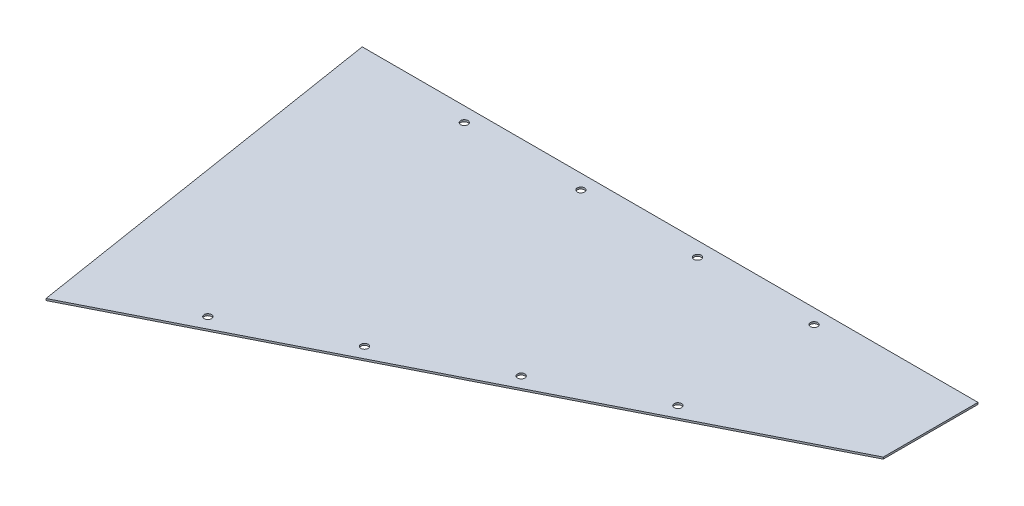
ISO-10303-21;
HEADER;
FILE_DESCRIPTION(('STEP AP214'),'2;1');
FILE_NAME('part.step','',(''),(''),'','','');
FILE_SCHEMA(('AUTOMOTIVE_DESIGN { 1 0 10303 214 1 1 1 1 }'));
ENDSEC;
DATA;
#1=APPLICATION_CONTEXT('core data for automotive mechanical design processes');
#2=APPLICATION_PROTOCOL_DEFINITION('international standard','automotive_design',2000,#1);
#3=PRODUCT_CONTEXT('',#1,'mechanical');
#4=PRODUCT('Part','Part','',(#3));
#5=PRODUCT_RELATED_PRODUCT_CATEGORY('part','',(#4));
#6=PRODUCT_DEFINITION_FORMATION('','',#4);
#7=PRODUCT_DEFINITION_CONTEXT('part definition',#1,'design');
#8=PRODUCT_DEFINITION('design','',#6,#7);
#9=PRODUCT_DEFINITION_SHAPE('','',#8);
#10=(LENGTH_UNIT() NAMED_UNIT(*) SI_UNIT(.MILLI.,.METRE.));
#11=(NAMED_UNIT(*) PLANE_ANGLE_UNIT() SI_UNIT($,.RADIAN.));
#12=(NAMED_UNIT(*) SI_UNIT($,.STERADIAN.) SOLID_ANGLE_UNIT());
#13=UNCERTAINTY_MEASURE_WITH_UNIT(LENGTH_MEASURE(1.E-05),#10,'distance_accuracy_value','');
#14=(GEOMETRIC_REPRESENTATION_CONTEXT(3) GLOBAL_UNCERTAINTY_ASSIGNED_CONTEXT((#13)) GLOBAL_UNIT_ASSIGNED_CONTEXT((#10,
#11,#12)) REPRESENTATION_CONTEXT('',''));
#15=CARTESIAN_POINT('',(0.,0.,0.));
#16=DIRECTION('',(0.,0.,1.));
#17=DIRECTION('',(1.,0.,0.));
#18=AXIS2_PLACEMENT_3D('',#15,#16,#17);
#19=CARTESIAN_POINT('',(-968.887028117865,3.175,490.232750073812));
#20=DIRECTION('',(-0.451473730325378,0.,-0.89228441139924));
#21=DIRECTION('',(-0.89228441139924,0.,0.451473730325378));
#22=AXIS2_PLACEMENT_3D('',#19,#20,#21);
#23=PLANE('',#22);
#24=DIRECTION('',(0.89228441139924,0.,-0.451473730325378));
#25=VECTOR('',#24,1.);
#26=CARTESIAN_POINT('',(-968.887028117865,0.,490.232750073812));
#27=LINE('',#26,#25);
#28=CARTESIAN_POINT('',(-968.887028117865,0.,490.232750073812));
#29=VERTEX_POINT('',#28);
#30=CARTESIAN_POINT('',(0.,0.,0.));
#31=VERTEX_POINT('',#30);
#32=EDGE_CURVE('E95',#29,#31,#27,.T.);
#33=ORIENTED_EDGE('',*,*,#32,.T.);
#34=DIRECTION('',(0.,-1.,0.));
#35=VECTOR('',#34,1.);
#36=CARTESIAN_POINT('',(0.,3.175,0.));
#37=LINE('',#36,#35);
#38=CARTESIAN_POINT('',(0.,3.175,0.));
#39=VERTEX_POINT('',#38);
#40=EDGE_CURVE('E11',#39,#31,#37,.T.);
#41=ORIENTED_EDGE('',*,*,#40,.F.);
#42=DIRECTION('',(0.89228441139924,0.,-0.451473730325378));
#43=VECTOR('',#42,1.);
#44=CARTESIAN_POINT('',(-968.887028117865,3.175,490.232750073812));
#45=LINE('',#44,#43);
#46=CARTESIAN_POINT('',(-968.887028117865,3.175,490.232750073812));
#47=VERTEX_POINT('',#46);
#48=EDGE_CURVE('E83',#47,#39,#45,.T.);
#49=ORIENTED_EDGE('',*,*,#48,.F.);
#50=DIRECTION('',(0.,-1.,0.));
#51=VECTOR('',#50,1.);
#52=CARTESIAN_POINT('',(-968.887028117865,3.175,490.232750073812));
#53=LINE('',#52,#51);
#54=EDGE_CURVE('E91',#47,#29,#53,.T.);
#55=ORIENTED_EDGE('',*,*,#54,.T.);
#56=EDGE_LOOP('',(#33,#41,#49,#55));
#57=FACE_BOUND('',#56,.T.);
#58=ADVANCED_FACE('F32',(#57),#23,.F.);
#59=CARTESIAN_POINT('',(0.,3.175,0.));
#60=DIRECTION('',(-1.,0.,0.));
#61=DIRECTION('',(0.,0.,1.));
#62=AXIS2_PLACEMENT_3D('',#59,#60,#61);
#63=PLANE('',#62);
#64=DIRECTION('',(0.,0.,-1.));
#65=VECTOR('',#64,1.);
#66=CARTESIAN_POINT('',(0.,0.,0.));
#67=LINE('',#66,#65);
#68=CARTESIAN_POINT('',(0.,0.,-165.1));
#69=VERTEX_POINT('',#68);
#70=EDGE_CURVE('E87',#31,#69,#67,.T.);
#71=ORIENTED_EDGE('',*,*,#70,.T.);
#72=DIRECTION('',(0.,-1.,0.));
#73=VECTOR('',#72,1.);
#74=CARTESIAN_POINT('',(0.,3.175,-165.1));
#75=LINE('',#74,#73);
#76=CARTESIAN_POINT('',(0.,3.175,-165.1));
#77=VERTEX_POINT('',#76);
#78=EDGE_CURVE('E40',#77,#69,#75,.T.);
#79=ORIENTED_EDGE('',*,*,#78,.F.);
#80=DIRECTION('',(0.,0.,-1.));
#81=VECTOR('',#80,1.);
#82=CARTESIAN_POINT('',(0.,3.175,0.));
#83=LINE('',#82,#81);
#84=EDGE_CURVE('E78',#39,#77,#83,.T.);
#85=ORIENTED_EDGE('',*,*,#84,.F.);
#86=ORIENTED_EDGE('',*,*,#40,.T.);
#87=EDGE_LOOP('',(#71,#79,#85,#86));
#88=FACE_BOUND('',#87,.T.);
#89=ADVANCED_FACE('F86',(#88),#63,.F.);
#90=CARTESIAN_POINT('',(0.,3.175,-165.1));
#91=DIRECTION('',(0.,0.,1.));
#92=DIRECTION('',(1.,0.,0.));
#93=AXIS2_PLACEMENT_3D('',#90,#91,#92);
#94=PLANE('',#93);
#95=DIRECTION('',(-1.,0.,0.));
#96=VECTOR('',#95,1.);
#97=CARTESIAN_POINT('',(0.,0.,-165.1));
#98=LINE('',#97,#96);
#99=CARTESIAN_POINT('',(-1073.15,0.,-165.1));
#100=VERTEX_POINT('',#99);
#101=EDGE_CURVE('E65',#69,#100,#98,.T.);
#102=ORIENTED_EDGE('',*,*,#101,.T.);
#103=DIRECTION('',(0.,-1.,0.));
#104=VECTOR('',#103,1.);
#105=CARTESIAN_POINT('',(-1073.15,3.175,-165.1));
#106=LINE('',#105,#104);
#107=CARTESIAN_POINT('',(-1073.15,3.175,-165.1));
#108=VERTEX_POINT('',#107);
#109=EDGE_CURVE('E88',#108,#100,#106,.T.);
#110=ORIENTED_EDGE('',*,*,#109,.F.);
#111=DIRECTION('',(-1.,0.,0.));
#112=VECTOR('',#111,1.);
#113=CARTESIAN_POINT('',(0.,3.175,-165.1));
#114=LINE('',#113,#112);
#115=EDGE_CURVE('E81',#77,#108,#114,.T.);
#116=ORIENTED_EDGE('',*,*,#115,.F.);
#117=ORIENTED_EDGE('',*,*,#78,.T.);
#118=EDGE_LOOP('',(#102,#110,#116,#117));
#119=FACE_BOUND('',#118,.T.);
#120=ADVANCED_FACE('F89',(#119),#94,.F.);
#121=CARTESIAN_POINT('',(-1073.15,3.175,-165.1));
#122=DIRECTION('',(0.987579022829087,0.,-0.157123116274928));
#123=DIRECTION('',(-0.157123116274928,0.,-0.987579022829088));
#124=AXIS2_PLACEMENT_3D('',#121,#122,#123);
#125=PLANE('',#124);
#126=DIRECTION('',(0.157123116274928,0.,0.987579022829088));
#127=VECTOR('',#126,1.);
#128=CARTESIAN_POINT('',(-1073.15,0.,-165.1));
#129=LINE('',#128,#127);
#130=EDGE_CURVE('E71',#100,#29,#129,.T.);
#131=ORIENTED_EDGE('',*,*,#130,.T.);
#132=ORIENTED_EDGE('',*,*,#54,.F.);
#133=DIRECTION('',(0.157123116274928,0.,0.987579022829088));
#134=VECTOR('',#133,1.);
#135=CARTESIAN_POINT('',(-1073.15,3.175,-165.1));
#136=LINE('',#135,#134);
#137=EDGE_CURVE('E48',#108,#47,#136,.T.);
#138=ORIENTED_EDGE('',*,*,#137,.F.);
#139=ORIENTED_EDGE('',*,*,#109,.T.);
#140=EDGE_LOOP('',(#131,#132,#138,#139));
#141=FACE_BOUND('',#140,.T.);
#142=ADVANCED_FACE('F103',(#141),#125,.F.);
#143=CARTESIAN_POINT('',(-968.887028117865,3.175,490.232750073812));
#144=DIRECTION('',(0.,-1.,0.));
#145=DIRECTION('',(0.,0.,-1.));
#146=AXIS2_PLACEMENT_3D('',#143,#144,#145);
#147=PLANE('',#146);
#148=CARTESIAN_POINT('',(-256.568144765759,3.175,101.350843122144));
#149=DIRECTION('',(0.,1.,0.));
#150=DIRECTION('',(0.,0.,1.));
#151=AXIS2_PLACEMENT_3D('',#148,#149,#150);
#152=CIRCLE('',#151,6.34999999999994);
#153=CARTESIAN_POINT('',(-256.568144765759,3.175,107.700843122144));
#154=VERTEX_POINT('',#153);
#155=EDGE_CURVE('E151',#154,#154,#152,.T.);
#156=ORIENTED_EDGE('',*,*,#155,.F.);
#157=EDGE_LOOP('',(#156));
#158=FACE_BOUND('',#157,.T.);
#159=CARTESIAN_POINT('',(-437.880337162085,3.175,193.090305124261));
#160=DIRECTION('',(0.,1.,0.));
#161=DIRECTION('',(0.,0.,1.));
#162=AXIS2_PLACEMENT_3D('',#159,#160,#161);
#163=CIRCLE('',#162,6.34999999999994);
#164=CARTESIAN_POINT('',(-437.880337162085,3.175,199.440305124261));
#165=VERTEX_POINT('',#164);
#166=EDGE_CURVE('E145',#165,#165,#163,.T.);
#167=ORIENTED_EDGE('',*,*,#166,.F.);
#168=EDGE_LOOP('',(#167));
#169=FACE_BOUND('',#168,.T.);
#170=CARTESIAN_POINT('',(-619.19252955841,3.175,284.829767126377));
#171=DIRECTION('',(0.,1.,0.));
#172=DIRECTION('',(0.,0.,1.));
#173=AXIS2_PLACEMENT_3D('',#170,#171,#172);
#174=CIRCLE('',#173,6.34999999999994);
#175=CARTESIAN_POINT('',(-619.19252955841,3.175,291.179767126377));
#176=VERTEX_POINT('',#175);
#177=EDGE_CURVE('E139',#176,#176,#174,.T.);
#178=ORIENTED_EDGE('',*,*,#177,.F.);
#179=EDGE_LOOP('',(#178));
#180=FACE_BOUND('',#179,.T.);
#181=CARTESIAN_POINT('',(-260.183056686401,3.175,-139.7));
#182=DIRECTION('',(0.,1.,0.));
#183=DIRECTION('',(0.,0.,1.));
#184=AXIS2_PLACEMENT_3D('',#181,#182,#183);
#185=CIRCLE('',#184,6.34999999999994);
#186=CARTESIAN_POINT('',(-260.183056686401,3.175,-133.35));
#187=VERTEX_POINT('',#186);
#188=EDGE_CURVE('E133',#187,#187,#185,.T.);
#189=ORIENTED_EDGE('',*,*,#188,.F.);
#190=EDGE_LOOP('',(#189));
#191=FACE_BOUND('',#190,.T.);
#192=CARTESIAN_POINT('',(-463.3830566864,3.175,-139.7));
#193=DIRECTION('',(0.,1.,0.));
#194=DIRECTION('',(0.,0.,1.));
#195=AXIS2_PLACEMENT_3D('',#192,#193,#194);
#196=CIRCLE('',#195,6.34999999999994);
#197=CARTESIAN_POINT('',(-463.3830566864,3.175,-133.35));
#198=VERTEX_POINT('',#197);
#199=EDGE_CURVE('E127',#198,#198,#196,.T.);
#200=ORIENTED_EDGE('',*,*,#199,.F.);
#201=EDGE_LOOP('',(#200));
#202=FACE_BOUND('',#201,.T.);
#203=CARTESIAN_POINT('',(-666.5830566864,3.175,-139.7));
#204=DIRECTION('',(0.,1.,0.));
#205=DIRECTION('',(0.,0.,1.));
#206=AXIS2_PLACEMENT_3D('',#203,#204,#205);
#207=CIRCLE('',#206,6.34999999999994);
#208=CARTESIAN_POINT('',(-666.5830566864,3.175,-133.35));
#209=VERTEX_POINT('',#208);
#210=EDGE_CURVE('E121',#209,#209,#207,.T.);
#211=ORIENTED_EDGE('',*,*,#210,.F.);
#212=EDGE_LOOP('',(#211));
#213=FACE_BOUND('',#212,.T.);
#214=CARTESIAN_POINT('',(-800.504721954735,3.175,376.569229128494));
#215=DIRECTION('',(0.,1.,0.));
#216=DIRECTION('',(0.,0.,1.));
#217=AXIS2_PLACEMENT_3D('',#214,#215,#216);
#218=CIRCLE('',#217,6.34999999999994);
#219=CARTESIAN_POINT('',(-800.504721954735,3.175,382.919229128494));
#220=VERTEX_POINT('',#219);
#221=EDGE_CURVE('E115',#220,#220,#218,.T.);
#222=ORIENTED_EDGE('',*,*,#221,.F.);
#223=EDGE_LOOP('',(#222));
#224=FACE_BOUND('',#223,.T.);
#225=CARTESIAN_POINT('',(-869.7830566864,3.175,-139.7));
#226=DIRECTION('',(0.,1.,0.));
#227=DIRECTION('',(0.,0.,1.));
#228=AXIS2_PLACEMENT_3D('',#225,#226,#227);
#229=CIRCLE('',#228,6.34999999999994);
#230=CARTESIAN_POINT('',(-869.7830566864,3.175,-133.35));
#231=VERTEX_POINT('',#230);
#232=EDGE_CURVE('E109',#231,#231,#229,.T.);
#233=ORIENTED_EDGE('',*,*,#232,.F.);
#234=EDGE_LOOP('',(#233));
#235=FACE_BOUND('',#234,.T.);
#236=ORIENTED_EDGE('',*,*,#48,.T.);
#237=ORIENTED_EDGE('',*,*,#84,.T.);
#238=ORIENTED_EDGE('',*,*,#115,.T.);
#239=ORIENTED_EDGE('',*,*,#137,.T.);
#240=EDGE_LOOP('',(#236,#237,#238,#239));
#241=FACE_BOUND('',#240,.T.);
#242=ADVANCED_FACE('F79',(#158,#169,#180,#191,#202,#213,#224,#235,#241),#147,.F.);
#243=CARTESIAN_POINT('',(-968.887028117865,0.,490.232750073812));
#244=DIRECTION('',(0.,-1.,0.));
#245=DIRECTION('',(0.,0.,-1.));
#246=AXIS2_PLACEMENT_3D('',#243,#244,#245);
#247=PLANE('',#246);
#248=CARTESIAN_POINT('',(-256.568144765759,0.,101.350843122144));
#249=DIRECTION('',(0.,1.,0.));
#250=DIRECTION('',(0.,0.,1.));
#251=AXIS2_PLACEMENT_3D('',#248,#249,#250);
#252=CIRCLE('',#251,6.34999999999994);
#253=CARTESIAN_POINT('',(-256.568144765759,0.,107.700843122144));
#254=VERTEX_POINT('',#253);
#255=EDGE_CURVE('E148',#254,#254,#252,.T.);
#256=ORIENTED_EDGE('',*,*,#255,.T.);
#257=EDGE_LOOP('',(#256));
#258=FACE_BOUND('',#257,.T.);
#259=CARTESIAN_POINT('',(-437.880337162085,0.,193.090305124261));
#260=DIRECTION('',(0.,1.,0.));
#261=DIRECTION('',(0.,0.,1.));
#262=AXIS2_PLACEMENT_3D('',#259,#260,#261);
#263=CIRCLE('',#262,6.34999999999994);
#264=CARTESIAN_POINT('',(-437.880337162085,0.,199.440305124261));
#265=VERTEX_POINT('',#264);
#266=EDGE_CURVE('E142',#265,#265,#263,.T.);
#267=ORIENTED_EDGE('',*,*,#266,.T.);
#268=EDGE_LOOP('',(#267));
#269=FACE_BOUND('',#268,.T.);
#270=CARTESIAN_POINT('',(-619.19252955841,0.,284.829767126377));
#271=DIRECTION('',(0.,1.,0.));
#272=DIRECTION('',(0.,0.,1.));
#273=AXIS2_PLACEMENT_3D('',#270,#271,#272);
#274=CIRCLE('',#273,6.34999999999994);
#275=CARTESIAN_POINT('',(-619.19252955841,0.,291.179767126377));
#276=VERTEX_POINT('',#275);
#277=EDGE_CURVE('E136',#276,#276,#274,.T.);
#278=ORIENTED_EDGE('',*,*,#277,.T.);
#279=EDGE_LOOP('',(#278));
#280=FACE_BOUND('',#279,.T.);
#281=CARTESIAN_POINT('',(-260.183056686401,0.,-139.7));
#282=DIRECTION('',(0.,1.,0.));
#283=DIRECTION('',(0.,0.,1.));
#284=AXIS2_PLACEMENT_3D('',#281,#282,#283);
#285=CIRCLE('',#284,6.34999999999994);
#286=CARTESIAN_POINT('',(-260.183056686401,0.,-133.35));
#287=VERTEX_POINT('',#286);
#288=EDGE_CURVE('E130',#287,#287,#285,.T.);
#289=ORIENTED_EDGE('',*,*,#288,.T.);
#290=EDGE_LOOP('',(#289));
#291=FACE_BOUND('',#290,.T.);
#292=CARTESIAN_POINT('',(-463.3830566864,0.,-139.7));
#293=DIRECTION('',(0.,1.,0.));
#294=DIRECTION('',(0.,0.,1.));
#295=AXIS2_PLACEMENT_3D('',#292,#293,#294);
#296=CIRCLE('',#295,6.34999999999994);
#297=CARTESIAN_POINT('',(-463.3830566864,0.,-133.35));
#298=VERTEX_POINT('',#297);
#299=EDGE_CURVE('E124',#298,#298,#296,.T.);
#300=ORIENTED_EDGE('',*,*,#299,.T.);
#301=EDGE_LOOP('',(#300));
#302=FACE_BOUND('',#301,.T.);
#303=CARTESIAN_POINT('',(-666.5830566864,0.,-139.7));
#304=DIRECTION('',(0.,1.,0.));
#305=DIRECTION('',(0.,0.,1.));
#306=AXIS2_PLACEMENT_3D('',#303,#304,#305);
#307=CIRCLE('',#306,6.34999999999994);
#308=CARTESIAN_POINT('',(-666.5830566864,0.,-133.35));
#309=VERTEX_POINT('',#308);
#310=EDGE_CURVE('E118',#309,#309,#307,.T.);
#311=ORIENTED_EDGE('',*,*,#310,.T.);
#312=EDGE_LOOP('',(#311));
#313=FACE_BOUND('',#312,.T.);
#314=CARTESIAN_POINT('',(-800.504721954735,0.,376.569229128494));
#315=DIRECTION('',(0.,1.,0.));
#316=DIRECTION('',(0.,0.,1.));
#317=AXIS2_PLACEMENT_3D('',#314,#315,#316);
#318=CIRCLE('',#317,6.34999999999994);
#319=CARTESIAN_POINT('',(-800.504721954735,0.,382.919229128494));
#320=VERTEX_POINT('',#319);
#321=EDGE_CURVE('E112',#320,#320,#318,.T.);
#322=ORIENTED_EDGE('',*,*,#321,.T.);
#323=EDGE_LOOP('',(#322));
#324=FACE_BOUND('',#323,.T.);
#325=CARTESIAN_POINT('',(-869.7830566864,0.,-139.7));
#326=DIRECTION('',(0.,1.,0.));
#327=DIRECTION('',(0.,0.,1.));
#328=AXIS2_PLACEMENT_3D('',#325,#326,#327);
#329=CIRCLE('',#328,6.34999999999994);
#330=CARTESIAN_POINT('',(-869.7830566864,0.,-133.35));
#331=VERTEX_POINT('',#330);
#332=EDGE_CURVE('E98',#331,#331,#329,.T.);
#333=ORIENTED_EDGE('',*,*,#332,.T.);
#334=EDGE_LOOP('',(#333));
#335=FACE_BOUND('',#334,.T.);
#336=ORIENTED_EDGE('',*,*,#32,.F.);
#337=ORIENTED_EDGE('',*,*,#130,.F.);
#338=ORIENTED_EDGE('',*,*,#101,.F.);
#339=ORIENTED_EDGE('',*,*,#70,.F.);
#340=EDGE_LOOP('',(#336,#337,#338,#339));
#341=FACE_BOUND('',#340,.T.);
#342=ADVANCED_FACE('F106',(#258,#269,#280,#291,#302,#313,#324,#335,#341),#247,.T.);
#343=CARTESIAN_POINT('',(-869.7830566864,0.,-139.7));
#344=DIRECTION('',(0.,1.,0.));
#345=DIRECTION('',(0.,0.,1.));
#346=AXIS2_PLACEMENT_3D('',#343,#344,#345);
#347=CYLINDRICAL_SURFACE('',#346,6.34999999999994);
#348=ORIENTED_EDGE('',*,*,#332,.F.);
#349=EDGE_LOOP('',(#348));
#350=FACE_BOUND('',#349,.T.);
#351=ORIENTED_EDGE('',*,*,#232,.T.);
#352=EDGE_LOOP('',(#351));
#353=FACE_BOUND('',#352,.T.);
#354=ADVANCED_FACE('F183',(#350,#353),#347,.F.);
#355=CARTESIAN_POINT('',(-800.504721954735,0.,376.569229128494));
#356=DIRECTION('',(0.,1.,0.));
#357=DIRECTION('',(0.,0.,1.));
#358=AXIS2_PLACEMENT_3D('',#355,#356,#357);
#359=CYLINDRICAL_SURFACE('',#358,6.34999999999994);
#360=ORIENTED_EDGE('',*,*,#321,.F.);
#361=EDGE_LOOP('',(#360));
#362=FACE_BOUND('',#361,.T.);
#363=ORIENTED_EDGE('',*,*,#221,.T.);
#364=EDGE_LOOP('',(#363));
#365=FACE_BOUND('',#364,.T.);
#366=ADVANCED_FACE('F185',(#362,#365),#359,.F.);
#367=CARTESIAN_POINT('',(-666.5830566864,0.,-139.7));
#368=DIRECTION('',(0.,1.,0.));
#369=DIRECTION('',(0.,0.,1.));
#370=AXIS2_PLACEMENT_3D('',#367,#368,#369);
#371=CYLINDRICAL_SURFACE('',#370,6.34999999999994);
#372=ORIENTED_EDGE('',*,*,#310,.F.);
#373=EDGE_LOOP('',(#372));
#374=FACE_BOUND('',#373,.T.);
#375=ORIENTED_EDGE('',*,*,#210,.T.);
#376=EDGE_LOOP('',(#375));
#377=FACE_BOUND('',#376,.T.);
#378=ADVANCED_FACE('F192',(#374,#377),#371,.F.);
#379=CARTESIAN_POINT('',(-463.3830566864,0.,-139.7));
#380=DIRECTION('',(0.,1.,0.));
#381=DIRECTION('',(0.,0.,1.));
#382=AXIS2_PLACEMENT_3D('',#379,#380,#381);
#383=CYLINDRICAL_SURFACE('',#382,6.34999999999994);
#384=ORIENTED_EDGE('',*,*,#299,.F.);
#385=EDGE_LOOP('',(#384));
#386=FACE_BOUND('',#385,.T.);
#387=ORIENTED_EDGE('',*,*,#199,.T.);
#388=EDGE_LOOP('',(#387));
#389=FACE_BOUND('',#388,.T.);
#390=ADVANCED_FACE('F240',(#386,#389),#383,.F.);
#391=CARTESIAN_POINT('',(-260.183056686401,0.,-139.7));
#392=DIRECTION('',(0.,1.,0.));
#393=DIRECTION('',(0.,0.,1.));
#394=AXIS2_PLACEMENT_3D('',#391,#392,#393);
#395=CYLINDRICAL_SURFACE('',#394,6.34999999999994);
#396=ORIENTED_EDGE('',*,*,#288,.F.);
#397=EDGE_LOOP('',(#396));
#398=FACE_BOUND('',#397,.T.);
#399=ORIENTED_EDGE('',*,*,#188,.T.);
#400=EDGE_LOOP('',(#399));
#401=FACE_BOUND('',#400,.T.);
#402=ADVANCED_FACE('F250',(#398,#401),#395,.F.);
#403=CARTESIAN_POINT('',(-619.19252955841,0.,284.829767126377));
#404=DIRECTION('',(0.,1.,0.));
#405=DIRECTION('',(0.,0.,1.));
#406=AXIS2_PLACEMENT_3D('',#403,#404,#405);
#407=CYLINDRICAL_SURFACE('',#406,6.34999999999994);
#408=ORIENTED_EDGE('',*,*,#277,.F.);
#409=EDGE_LOOP('',(#408));
#410=FACE_BOUND('',#409,.T.);
#411=ORIENTED_EDGE('',*,*,#177,.T.);
#412=EDGE_LOOP('',(#411));
#413=FACE_BOUND('',#412,.T.);
#414=ADVANCED_FACE('F260',(#410,#413),#407,.F.);
#415=CARTESIAN_POINT('',(-437.880337162085,0.,193.090305124261));
#416=DIRECTION('',(0.,1.,0.));
#417=DIRECTION('',(0.,0.,1.));
#418=AXIS2_PLACEMENT_3D('',#415,#416,#417);
#419=CYLINDRICAL_SURFACE('',#418,6.34999999999994);
#420=ORIENTED_EDGE('',*,*,#266,.F.);
#421=EDGE_LOOP('',(#420));
#422=FACE_BOUND('',#421,.T.);
#423=ORIENTED_EDGE('',*,*,#166,.T.);
#424=EDGE_LOOP('',(#423));
#425=FACE_BOUND('',#424,.T.);
#426=ADVANCED_FACE('F162',(#422,#425),#419,.F.);
#427=CARTESIAN_POINT('',(-256.568144765759,0.,101.350843122144));
#428=DIRECTION('',(0.,1.,0.));
#429=DIRECTION('',(0.,0.,1.));
#430=AXIS2_PLACEMENT_3D('',#427,#428,#429);
#431=CYLINDRICAL_SURFACE('',#430,6.34999999999994);
#432=ORIENTED_EDGE('',*,*,#255,.F.);
#433=EDGE_LOOP('',(#432));
#434=FACE_BOUND('',#433,.T.);
#435=ORIENTED_EDGE('',*,*,#155,.T.);
#436=EDGE_LOOP('',(#435));
#437=FACE_BOUND('',#436,.T.);
#438=ADVANCED_FACE('F159',(#434,#437),#431,.F.);
#439=CLOSED_SHELL('',(#58,#89,#120,#142,#242,#342,#354,#366,#378,#390,#402,#414,#426,#438));
#440=MANIFOLD_SOLID_BREP('B2',#439);
#441=ADVANCED_BREP_SHAPE_REPRESENTATION('',(#18,#440),#14);
#442=SHAPE_DEFINITION_REPRESENTATION(#9,#441);
ENDSEC;
END-ISO-10303-21;
